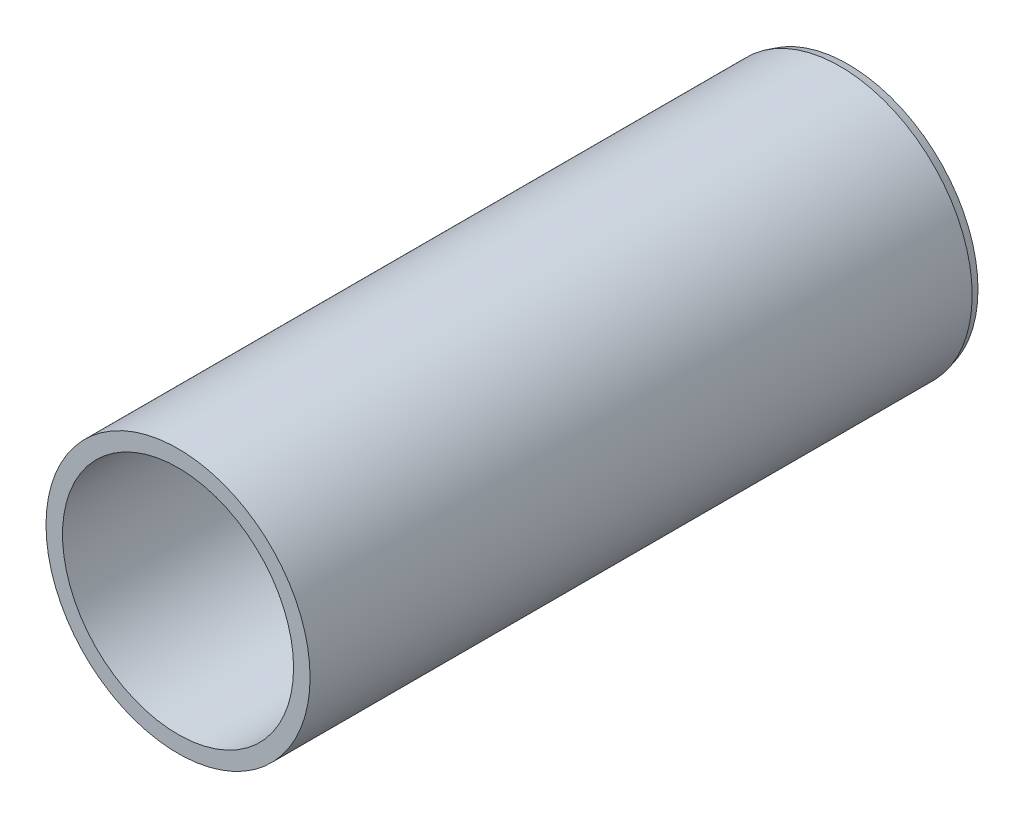
ISO-10303-21;
HEADER;
FILE_DESCRIPTION(('STEP AP214'),'2;1');
FILE_NAME('part.step','',(''),(''),'','','');
FILE_SCHEMA(('AUTOMOTIVE_DESIGN { 1 0 10303 214 1 1 1 1 }'));
ENDSEC;
DATA;
#1=APPLICATION_CONTEXT('core data for automotive mechanical design processes');
#2=APPLICATION_PROTOCOL_DEFINITION('international standard','automotive_design',2000,#1);
#3=PRODUCT_CONTEXT('',#1,'mechanical');
#4=PRODUCT('Part','Part','',(#3));
#5=PRODUCT_RELATED_PRODUCT_CATEGORY('part','',(#4));
#6=PRODUCT_DEFINITION_FORMATION('','',#4);
#7=PRODUCT_DEFINITION_CONTEXT('part definition',#1,'design');
#8=PRODUCT_DEFINITION('design','',#6,#7);
#9=PRODUCT_DEFINITION_SHAPE('','',#8);
#10=(LENGTH_UNIT() NAMED_UNIT(*) SI_UNIT(.MILLI.,.METRE.));
#11=(NAMED_UNIT(*) PLANE_ANGLE_UNIT() SI_UNIT($,.RADIAN.));
#12=(NAMED_UNIT(*) SI_UNIT($,.STERADIAN.) SOLID_ANGLE_UNIT());
#13=UNCERTAINTY_MEASURE_WITH_UNIT(LENGTH_MEASURE(1.E-05),#10,'distance_accuracy_value','');
#14=(GEOMETRIC_REPRESENTATION_CONTEXT(3) GLOBAL_UNCERTAINTY_ASSIGNED_CONTEXT((#13)) GLOBAL_UNIT_ASSIGNED_CONTEXT((#10,
#11,#12)) REPRESENTATION_CONTEXT('',''));
#15=CARTESIAN_POINT('',(0.,0.,0.));
#16=DIRECTION('',(0.,0.,1.));
#17=DIRECTION('',(1.,0.,0.));
#18=AXIS2_PLACEMENT_3D('',#15,#16,#17);
#19=CARTESIAN_POINT('',(16.,-16.2972214998846,81.2));
#20=DIRECTION('',(0.,0.,1.));
#21=DIRECTION('',(0.,1.,0.));
#22=AXIS2_PLACEMENT_3D('',#19,#20,#21);
#23=PLANE('',#22);
#24=CARTESIAN_POINT('',(0.,0.,81.2));
#25=DIRECTION('',(0.,0.,1.));
#26=DIRECTION('',(-1.,0.,0.));
#27=AXIS2_PLACEMENT_3D('',#24,#25,#26);
#28=CIRCLE('',#27,16.);
#29=CARTESIAN_POINT('',(-16.,0.,81.2));
#30=VERTEX_POINT('',#29);
#31=EDGE_CURVE('E35',#30,#30,#28,.F.);
#32=ORIENTED_EDGE('',*,*,#31,.F.);
#33=EDGE_LOOP('',(#32));
#34=FACE_BOUND('',#33,.T.);
#35=CARTESIAN_POINT('',(0.,0.,81.2));
#36=DIRECTION('',(0.,0.,-1.));
#37=DIRECTION('',(1.,0.,0.));
#38=AXIS2_PLACEMENT_3D('',#35,#36,#37);
#39=CIRCLE('',#38,14.);
#40=CARTESIAN_POINT('',(14.,0.,81.2));
#41=VERTEX_POINT('',#40);
#42=EDGE_CURVE('E30',#41,#41,#39,.T.);
#43=ORIENTED_EDGE('',*,*,#42,.T.);
#44=EDGE_LOOP('',(#43));
#45=FACE_BOUND('',#44,.T.);
#46=ADVANCED_FACE('F15',(#34,#45),#23,.T.);
#47=CARTESIAN_POINT('',(-15.741180954897,-16.0335945432326,0.));
#48=DIRECTION('',(0.,0.,-1.));
#49=DIRECTION('',(0.,1.,0.));
#50=AXIS2_PLACEMENT_3D('',#47,#48,#49);
#51=PLANE('',#50);
#52=CARTESIAN_POINT('',(0.,0.,0.));
#53=DIRECTION('',(0.,0.,-1.));
#54=DIRECTION('',(1.,0.,0.));
#55=AXIS2_PLACEMENT_3D('',#52,#53,#54);
#56=CIRCLE('',#55,15.741180954897);
#57=CARTESIAN_POINT('',(15.741180954897,0.,0.));
#58=VERTEX_POINT('',#57);
#59=EDGE_CURVE('E26',#58,#58,#56,.T.);
#60=ORIENTED_EDGE('',*,*,#59,.T.);
#61=EDGE_LOOP('',(#60));
#62=FACE_BOUND('',#61,.T.);
#63=CARTESIAN_POINT('',(0.,0.,0.));
#64=DIRECTION('',(0.,0.,1.));
#65=DIRECTION('',(-1.,0.,0.));
#66=AXIS2_PLACEMENT_3D('',#63,#64,#65);
#67=CIRCLE('',#66,14.);
#68=CARTESIAN_POINT('',(-14.,0.,0.));
#69=VERTEX_POINT('',#68);
#70=EDGE_CURVE('E22',#69,#69,#67,.F.);
#71=ORIENTED_EDGE('',*,*,#70,.F.);
#72=EDGE_LOOP('',(#71));
#73=FACE_BOUND('',#72,.T.);
#74=ADVANCED_FACE('F43',(#62,#73),#51,.T.);
#75=CARTESIAN_POINT('',(0.,0.,0.));
#76=DIRECTION('',(0.,0.,-1.));
#77=DIRECTION('',(1.,0.,0.));
#78=AXIS2_PLACEMENT_3D('',#75,#76,#77);
#79=CYLINDRICAL_SURFACE('',#78,16.);
#80=CARTESIAN_POINT('',(0.,0.,0.965925826289066));
#81=DIRECTION('',(0.,0.,1.));
#82=DIRECTION('',(-1.,0.,0.));
#83=AXIS2_PLACEMENT_3D('',#80,#81,#82);
#84=CIRCLE('',#83,16.);
#85=CARTESIAN_POINT('',(-16.,0.,0.965925826289066));
#86=VERTEX_POINT('',#85);
#87=EDGE_CURVE('E10',#86,#86,#84,.F.);
#88=ORIENTED_EDGE('',*,*,#87,.F.);
#89=EDGE_LOOP('',(#88));
#90=FACE_BOUND('',#89,.T.);
#91=ORIENTED_EDGE('',*,*,#31,.T.);
#92=EDGE_LOOP('',(#91));
#93=FACE_BOUND('',#92,.T.);
#94=ADVANCED_FACE('F39',(#90,#93),#79,.T.);
#95=CARTESIAN_POINT('',(0.,0.,0.965925826289074));
#96=DIRECTION('',(0.,0.,1.));
#97=DIRECTION('',(-1.,0.,0.));
#98=AXIS2_PLACEMENT_3D('',#95,#96,#97);
#99=CONICAL_SURFACE('',#98,16.,0.261799387799609);
#100=ORIENTED_EDGE('',*,*,#59,.F.);
#101=EDGE_LOOP('',(#100));
#102=FACE_BOUND('',#101,.T.);
#103=ORIENTED_EDGE('',*,*,#87,.T.);
#104=EDGE_LOOP('',(#103));
#105=FACE_BOUND('',#104,.T.);
#106=ADVANCED_FACE('F48',(#102,#105),#99,.T.);
#107=CARTESIAN_POINT('',(0.,0.,0.));
#108=DIRECTION('',(0.,0.,-1.));
#109=DIRECTION('',(1.,0.,0.));
#110=AXIS2_PLACEMENT_3D('',#107,#108,#109);
#111=CYLINDRICAL_SURFACE('',#110,14.);
#112=ORIENTED_EDGE('',*,*,#70,.T.);
#113=EDGE_LOOP('',(#112));
#114=FACE_BOUND('',#113,.T.);
#115=ORIENTED_EDGE('',*,*,#42,.F.);
#116=EDGE_LOOP('',(#115));
#117=FACE_BOUND('',#116,.T.);
#118=ADVANCED_FACE('F17',(#114,#117),#111,.F.);
#119=CLOSED_SHELL('',(#46,#74,#94,#106,#118));
#120=MANIFOLD_SOLID_BREP('B1',#119);
#121=ADVANCED_BREP_SHAPE_REPRESENTATION('',(#18,#120),#14);
#122=SHAPE_DEFINITION_REPRESENTATION(#9,#121);
ENDSEC;
END-ISO-10303-21;
